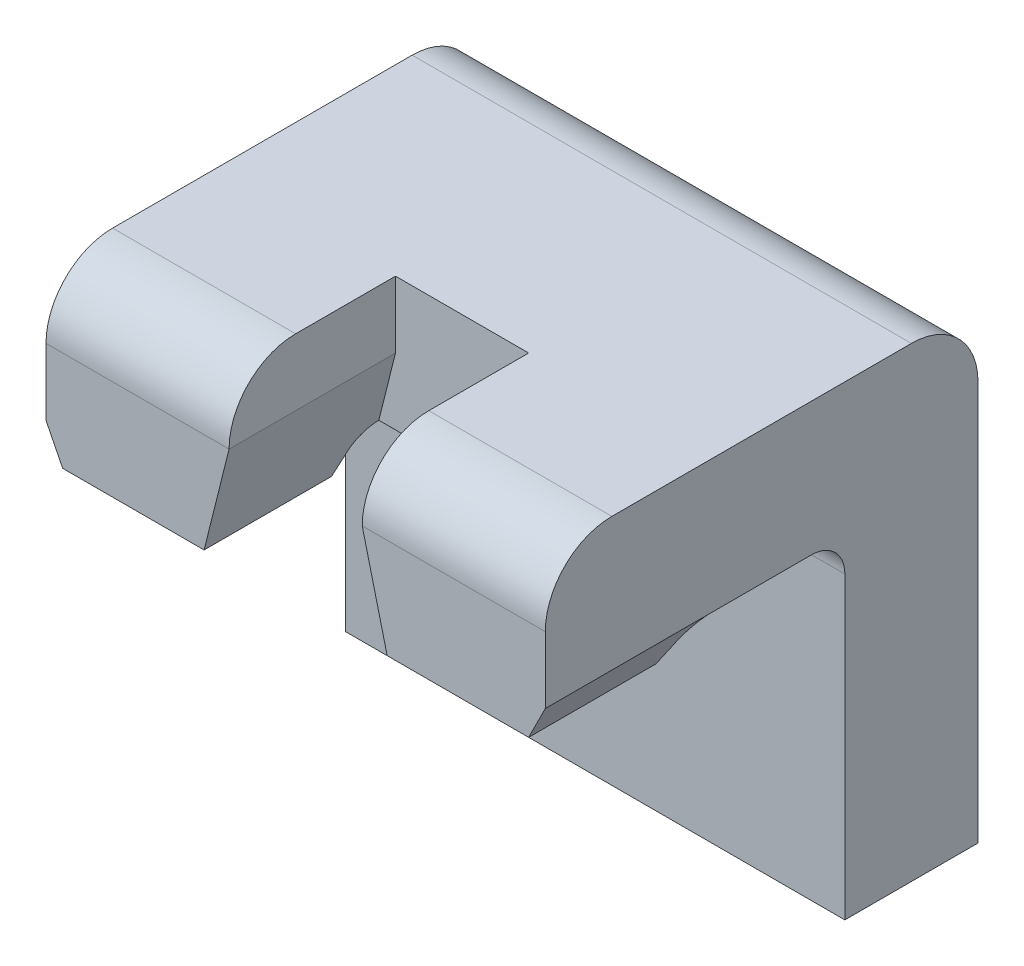
ISO-10303-21;
HEADER;
FILE_DESCRIPTION(('STEP AP214'),'2;1');
FILE_NAME('part.step','',(''),(''),'','','');
FILE_SCHEMA(('AUTOMOTIVE_DESIGN { 1 0 10303 214 1 1 1 1 }'));
ENDSEC;
DATA;
#1=APPLICATION_CONTEXT('core data for automotive mechanical design processes');
#2=APPLICATION_PROTOCOL_DEFINITION('international standard','automotive_design',2000,#1);
#3=PRODUCT_CONTEXT('',#1,'mechanical');
#4=PRODUCT('Part','Part','',(#3));
#5=PRODUCT_RELATED_PRODUCT_CATEGORY('part','',(#4));
#6=PRODUCT_DEFINITION_FORMATION('','',#4);
#7=PRODUCT_DEFINITION_CONTEXT('part definition',#1,'design');
#8=PRODUCT_DEFINITION('design','',#6,#7);
#9=PRODUCT_DEFINITION_SHAPE('','',#8);
#10=(LENGTH_UNIT() NAMED_UNIT(*) SI_UNIT(.MILLI.,.METRE.));
#11=(NAMED_UNIT(*) PLANE_ANGLE_UNIT() SI_UNIT($,.RADIAN.));
#12=(NAMED_UNIT(*) SI_UNIT($,.STERADIAN.) SOLID_ANGLE_UNIT());
#13=UNCERTAINTY_MEASURE_WITH_UNIT(LENGTH_MEASURE(1.E-05),#10,'distance_accuracy_value','');
#14=(GEOMETRIC_REPRESENTATION_CONTEXT(3) GLOBAL_UNCERTAINTY_ASSIGNED_CONTEXT((#13)) GLOBAL_UNIT_ASSIGNED_CONTEXT((#10,
#11,#12)) REPRESENTATION_CONTEXT('',''));
#15=CARTESIAN_POINT('',(0.,0.,0.));
#16=DIRECTION('',(0.,0.,1.));
#17=DIRECTION('',(1.,0.,0.));
#18=AXIS2_PLACEMENT_3D('',#15,#16,#17);
#19=CARTESIAN_POINT('',(-0.415796148106,0.4,0.49));
#20=DIRECTION('',(0.,0.531864359009179,0.846829559956285));
#21=DIRECTION('',(0.,-0.846829559956285,0.531864359009179));
#22=AXIS2_PLACEMENT_3D('',#19,#20,#21);
#23=PLANE('',#22);
#24=DIRECTION('',(-1.,0.,0.));
#25=VECTOR('',#24,1.);
#26=CARTESIAN_POINT('',(0.875,0.45,0.45859672925));
#27=LINE('',#26,#25);
#28=CARTESIAN_POINT('',(0.35,0.45,0.45859672925));
#29=VERTEX_POINT('',#28);
#30=CARTESIAN_POINT('',(0.137500000000008,0.450000000000002,0.45859672925));
#31=VERTEX_POINT('',#30);
#32=EDGE_CURVE('E301',#29,#31,#27,.T.);
#33=ORIENTED_EDGE('',*,*,#32,.T.);
#34=DIRECTION('',(-0.207116775159689,0.82846710063961,-0.520331533356617));
#35=VECTOR('',#34,1.);
#36=CARTESIAN_POINT('',(0.137500000000012,0.450000000000003,0.45859672925));
#37=LINE('',#36,#35);
#38=CARTESIAN_POINT('',(0.132202135712893,0.471191457148502,0.445287107921827));
#39=VERTEX_POINT('',#38);
#40=EDGE_CURVE('E274',#31,#39,#37,.T.);
#41=ORIENTED_EDGE('',*,*,#40,.T.);
#42=DIRECTION('',(1.,0.,0.));
#43=VECTOR('',#42,1.);
#44=CARTESIAN_POINT('',(-0.375,0.47119145714682,0.445287107922614));
#45=LINE('',#44,#43);
#46=CARTESIAN_POINT('',(0.360595728573993,0.471191457147986,0.445287107922069));
#47=VERTEX_POINT('',#46);
#48=EDGE_CURVE('E178',#39,#47,#45,.T.);
#49=ORIENTED_EDGE('',*,*,#48,.T.);
#50=DIRECTION('',(-0.389903858619995,-0.779807717239989,0.489770257535302));
#51=VECTOR('',#50,1.);
#52=CARTESIAN_POINT('',(0.3605957285734,0.4711914571468,0.445287107923));
#53=LINE('',#52,#51);
#54=EDGE_CURVE('E291',#47,#29,#53,.T.);
#55=ORIENTED_EDGE('',*,*,#54,.T.);
#56=EDGE_LOOP('',(#33,#41,#49,#55));
#57=FACE_BOUND('',#56,.T.);
#58=ADVANCED_FACE('F17',(#57),#23,.F.);
#59=CARTESIAN_POINT('',(0.875,0.45,0.));
#60=DIRECTION('',(0.,1.,0.));
#61=DIRECTION('',(-1.,0.,0.));
#62=AXIS2_PLACEMENT_3D('',#59,#60,#61);
#63=PLANE('',#62);
#64=DIRECTION('',(0.,0.,1.));
#65=VECTOR('',#64,1.);
#66=CARTESIAN_POINT('',(0.35,0.45,0.4));
#67=LINE('',#66,#65);
#68=CARTESIAN_POINT('',(0.35,0.45,0.65));
#69=VERTEX_POINT('',#68);
#70=EDGE_CURVE('E288',#29,#69,#67,.T.);
#71=ORIENTED_EDGE('',*,*,#70,.T.);
#72=DIRECTION('',(1.,0.,0.));
#73=VECTOR('',#72,1.);
#74=CARTESIAN_POINT('',(-0.375,0.45,0.65));
#75=LINE('',#74,#73);
#76=CARTESIAN_POINT('',(0.137500000000006,0.450000000000001,0.65));
#77=VERTEX_POINT('',#76);
#78=EDGE_CURVE('E290',#77,#69,#75,.T.);
#79=ORIENTED_EDGE('',*,*,#78,.F.);
#80=DIRECTION('',(0.,0.,1.));
#81=VECTOR('',#80,1.);
#82=CARTESIAN_POINT('',(0.137500000000012,0.450000000000003,0.4));
#83=LINE('',#82,#81);
#84=EDGE_CURVE('E279',#77,#31,#83,.F.);
#85=ORIENTED_EDGE('',*,*,#84,.T.);
#86=ORIENTED_EDGE('',*,*,#32,.F.);
#87=EDGE_LOOP('',(#71,#79,#85,#86));
#88=FACE_BOUND('',#87,.T.);
#89=ADVANCED_FACE('F391',(#88),#63,.F.);
#90=CARTESIAN_POINT('',(0.15,0.4,0.4));
#91=DIRECTION('',(0.970142500145391,0.242535625036098,0.));
#92=DIRECTION('',(-0.242535625036098,0.970142500145391,0.));
#93=AXIS2_PLACEMENT_3D('',#90,#91,#92);
#94=PLANE('',#93);
#95=ORIENTED_EDGE('',*,*,#84,.F.);
#96=DIRECTION('',(0.242535625036333,-0.970142500145332,0.));
#97=VECTOR('',#96,1.);
#98=CARTESIAN_POINT('',(0.1,0.6,0.65));
#99=LINE('',#98,#97);
#100=CARTESIAN_POINT('',(0.1,0.6,0.65));
#101=VERTEX_POINT('',#100);
#102=EDGE_CURVE('E282',#101,#77,#99,.T.);
#103=ORIENTED_EDGE('',*,*,#102,.F.);
#104=DIRECTION('',(0.,0.,1.));
#105=VECTOR('',#104,1.);
#106=CARTESIAN_POINT('',(0.1,0.6,0.4));
#107=LINE('',#106,#105);
#108=CARTESIAN_POINT('',(0.1,0.6,0.4));
#109=VERTEX_POINT('',#108);
#110=EDGE_CURVE('E164',#101,#109,#107,.F.);
#111=ORIENTED_EDGE('',*,*,#110,.T.);
#112=DIRECTION('',(0.242535625036333,-0.970142500145332,0.));
#113=VECTOR('',#112,1.);
#114=CARTESIAN_POINT('',(0.1,0.6,0.4));
#115=LINE('',#114,#113);
#116=CARTESIAN_POINT('',(0.125000000000013,0.5,0.4));
#117=VERTEX_POINT('',#116);
#118=EDGE_CURVE('E157',#109,#117,#115,.T.);
#119=ORIENTED_EDGE('',*,*,#118,.T.);
#120=CARTESIAN_POINT('',(0.137500000000013,0.45,0.4));
#121=DIRECTION('',(0.970142500145391,0.242535625036098,0.));
#122=DIRECTION('',(0.242535625036098,-0.970142500145391,0.));
#123=AXIS2_PLACEMENT_3D('',#120,#121,#122);
#124=ELLIPSE('',#123,0.0515388203202176,0.05);
#125=EDGE_CURVE('E20',#117,#39,#124,.T.);
#126=ORIENTED_EDGE('',*,*,#125,.T.);
#127=ORIENTED_EDGE('',*,*,#40,.F.);
#128=EDGE_LOOP('',(#95,#103,#111,#119,#126,#127));
#129=FACE_BOUND('',#128,.T.);
#130=ADVANCED_FACE('F160',(#129),#94,.F.);
#131=CARTESIAN_POINT('',(-0.415796148106,0.4,0.49));
#132=DIRECTION('',(0.,0.531864359009179,0.846829559956285));
#133=DIRECTION('',(0.,-0.846829559956285,0.531864359009179));
#134=AXIS2_PLACEMENT_3D('',#131,#132,#133);
#135=PLANE('',#134);
#136=DIRECTION('',(-1.,0.,0.));
#137=VECTOR('',#136,1.);
#138=CARTESIAN_POINT('',(0.875,0.45,0.45859672925));
#139=LINE('',#138,#137);
#140=CARTESIAN_POINT('',(-0.137500000000008,0.450000000000002,0.45859672925));
#141=VERTEX_POINT('',#140);
#142=CARTESIAN_POINT('',(-0.35,0.45,0.45859672925));
#143=VERTEX_POINT('',#142);
#144=EDGE_CURVE('E267',#141,#143,#139,.T.);
#145=ORIENTED_EDGE('',*,*,#144,.T.);
#146=DIRECTION('',(-0.389903858619995,0.779807717239989,-0.489770257535302));
#147=VECTOR('',#146,1.);
#148=CARTESIAN_POINT('',(-0.35,0.45,0.45859672925));
#149=LINE('',#148,#147);
#150=CARTESIAN_POINT('',(-0.360595728573993,0.471191457147986,0.445287107922069));
#151=VERTEX_POINT('',#150);
#152=EDGE_CURVE('E257',#143,#151,#149,.T.);
#153=ORIENTED_EDGE('',*,*,#152,.T.);
#154=DIRECTION('',(1.,0.,0.));
#155=VECTOR('',#154,1.);
#156=CARTESIAN_POINT('',(-0.375,0.47119145714682,0.445287107922614));
#157=LINE('',#156,#155);
#158=CARTESIAN_POINT('',(-0.132202135712893,0.471191457148502,0.445287107921827));
#159=VERTEX_POINT('',#158);
#160=EDGE_CURVE('E209',#151,#159,#157,.T.);
#161=ORIENTED_EDGE('',*,*,#160,.T.);
#162=DIRECTION('',(-0.207116775159689,-0.82846710063961,0.520331533356617));
#163=VECTOR('',#162,1.);
#164=CARTESIAN_POINT('',(-0.132202135713253,0.471191457147063,0.445287107923));
#165=LINE('',#164,#163);
#166=EDGE_CURVE('E265',#159,#141,#165,.T.);
#167=ORIENTED_EDGE('',*,*,#166,.T.);
#168=EDGE_LOOP('',(#145,#153,#161,#167));
#169=FACE_BOUND('',#168,.T.);
#170=ADVANCED_FACE('F425',(#169),#135,.F.);
#171=CARTESIAN_POINT('',(0.875,0.45,0.));
#172=DIRECTION('',(0.,1.,0.));
#173=DIRECTION('',(-1.,0.,0.));
#174=AXIS2_PLACEMENT_3D('',#171,#172,#173);
#175=PLANE('',#174);
#176=DIRECTION('',(0.,0.,1.));
#177=VECTOR('',#176,1.);
#178=CARTESIAN_POINT('',(-0.137500000000012,0.450000000000003,0.4));
#179=LINE('',#178,#177);
#180=CARTESIAN_POINT('',(-0.137500000000004,0.450000000000001,0.65));
#181=VERTEX_POINT('',#180);
#182=EDGE_CURVE('E241',#141,#181,#179,.T.);
#183=ORIENTED_EDGE('',*,*,#182,.T.);
#184=DIRECTION('',(1.,0.,0.));
#185=VECTOR('',#184,1.);
#186=CARTESIAN_POINT('',(-0.375,0.45,0.65));
#187=LINE('',#186,#185);
#188=CARTESIAN_POINT('',(-0.35,0.45,0.65));
#189=VERTEX_POINT('',#188);
#190=EDGE_CURVE('E251',#189,#181,#187,.T.);
#191=ORIENTED_EDGE('',*,*,#190,.F.);
#192=DIRECTION('',(0.,0.,1.));
#193=VECTOR('',#192,1.);
#194=CARTESIAN_POINT('',(-0.35,0.45,0.4));
#195=LINE('',#194,#193);
#196=EDGE_CURVE('E254',#189,#143,#195,.F.);
#197=ORIENTED_EDGE('',*,*,#196,.T.);
#198=ORIENTED_EDGE('',*,*,#144,.F.);
#199=EDGE_LOOP('',(#183,#191,#197,#198));
#200=FACE_BOUND('',#199,.T.);
#201=ADVANCED_FACE('F419',(#200),#175,.F.);
#202=CARTESIAN_POINT('',(-0.15,0.4,0.4));
#203=DIRECTION('',(-0.970142500145391,0.242535625036098,0.));
#204=DIRECTION('',(-0.242535625036098,-0.970142500145391,0.));
#205=AXIS2_PLACEMENT_3D('',#202,#203,#204);
#206=PLANE('',#205);
#207=ORIENTED_EDGE('',*,*,#182,.F.);
#208=ORIENTED_EDGE('',*,*,#166,.F.);
#209=CARTESIAN_POINT('',(-0.137500000000013,0.45,0.4));
#210=DIRECTION('',(-0.970142500145391,0.242535625036098,0.));
#211=DIRECTION('',(0.242535625036098,0.970142500145391,0.));
#212=AXIS2_PLACEMENT_3D('',#209,#210,#211);
#213=ELLIPSE('',#212,0.0515388203202176,0.05);
#214=CARTESIAN_POINT('',(-0.125000000000013,0.5,0.4));
#215=VERTEX_POINT('',#214);
#216=EDGE_CURVE('E210',#159,#215,#213,.T.);
#217=ORIENTED_EDGE('',*,*,#216,.T.);
#218=DIRECTION('',(0.242535625036333,0.970142500145332,0.));
#219=VECTOR('',#218,1.);
#220=CARTESIAN_POINT('',(-0.125,0.5,0.4));
#221=LINE('',#220,#219);
#222=CARTESIAN_POINT('',(-0.1,0.6,0.4));
#223=VERTEX_POINT('',#222);
#224=EDGE_CURVE('E169',#215,#223,#221,.T.);
#225=ORIENTED_EDGE('',*,*,#224,.T.);
#226=DIRECTION('',(0.,0.,1.));
#227=VECTOR('',#226,1.);
#228=CARTESIAN_POINT('',(-0.1,0.6,0.4));
#229=LINE('',#228,#227);
#230=CARTESIAN_POINT('',(-0.1,0.6,0.65));
#231=VERTEX_POINT('',#230);
#232=EDGE_CURVE('E218',#223,#231,#229,.T.);
#233=ORIENTED_EDGE('',*,*,#232,.T.);
#234=DIRECTION('',(0.242535625036333,0.970142500145332,0.));
#235=VECTOR('',#234,1.);
#236=CARTESIAN_POINT('',(-0.1375,0.45,0.65));
#237=LINE('',#236,#235);
#238=EDGE_CURVE('E247',#181,#231,#237,.T.);
#239=ORIENTED_EDGE('',*,*,#238,.F.);
#240=EDGE_LOOP('',(#207,#208,#217,#225,#233,#239));
#241=FACE_BOUND('',#240,.T.);
#242=ADVANCED_FACE('F340',(#241),#206,.F.);
#243=CARTESIAN_POINT('',(0.1,0.4,0.4));
#244=DIRECTION('',(1.,0.,0.));
#245=DIRECTION('',(0.,1.,0.));
#246=AXIS2_PLACEMENT_3D('',#243,#244,#245);
#247=PLANE('',#246);
#248=ORIENTED_EDGE('',*,*,#110,.F.);
#249=CARTESIAN_POINT('',(0.1,0.6,0.55));
#250=DIRECTION('',(1.,0.,0.));
#251=DIRECTION('',(0.,0.,-1.));
#252=AXIS2_PLACEMENT_3D('',#249,#250,#251);
#253=CIRCLE('',#252,0.1);
#254=CARTESIAN_POINT('',(0.1,0.7,0.55));
#255=VERTEX_POINT('',#254);
#256=EDGE_CURVE('E334',#255,#101,#253,.T.);
#257=ORIENTED_EDGE('',*,*,#256,.F.);
#258=DIRECTION('',(0.,0.,1.));
#259=VECTOR('',#258,1.);
#260=CARTESIAN_POINT('',(0.1,0.7,0.55));
#261=LINE('',#260,#259);
#262=CARTESIAN_POINT('',(0.1,0.7,0.4));
#263=VERTEX_POINT('',#262);
#264=EDGE_CURVE('E208',#263,#255,#261,.T.);
#265=ORIENTED_EDGE('',*,*,#264,.F.);
#266=DIRECTION('',(0.,1.,0.));
#267=VECTOR('',#266,1.);
#268=CARTESIAN_POINT('',(0.1,0.7,0.4));
#269=LINE('',#268,#267);
#270=EDGE_CURVE('E170',#263,#109,#269,.F.);
#271=ORIENTED_EDGE('',*,*,#270,.T.);
#272=EDGE_LOOP('',(#248,#257,#265,#271));
#273=FACE_BOUND('',#272,.T.);
#274=ADVANCED_FACE('F404',(#273),#247,.F.);
#275=CARTESIAN_POINT('',(-0.1,0.4,0.4));
#276=DIRECTION('',(-1.,0.,0.));
#277=DIRECTION('',(0.,-1.,0.));
#278=AXIS2_PLACEMENT_3D('',#275,#276,#277);
#279=PLANE('',#278);
#280=ORIENTED_EDGE('',*,*,#232,.F.);
#281=DIRECTION('',(0.,1.,0.));
#282=VECTOR('',#281,1.);
#283=CARTESIAN_POINT('',(-0.1,0.7,0.4));
#284=LINE('',#283,#282);
#285=CARTESIAN_POINT('',(-0.1,0.7,0.4));
#286=VERTEX_POINT('',#285);
#287=EDGE_CURVE('E179',#223,#286,#284,.T.);
#288=ORIENTED_EDGE('',*,*,#287,.T.);
#289=DIRECTION('',(0.,0.,1.));
#290=VECTOR('',#289,1.);
#291=CARTESIAN_POINT('',(-0.1,0.7,0.55));
#292=LINE('',#291,#290);
#293=CARTESIAN_POINT('',(-0.1,0.7,0.55));
#294=VERTEX_POINT('',#293);
#295=EDGE_CURVE('E222',#294,#286,#292,.F.);
#296=ORIENTED_EDGE('',*,*,#295,.F.);
#297=CARTESIAN_POINT('',(-0.1,0.6,0.55));
#298=DIRECTION('',(1.,0.,0.));
#299=DIRECTION('',(0.,0.,-1.));
#300=AXIS2_PLACEMENT_3D('',#297,#298,#299);
#301=CIRCLE('',#300,0.1);
#302=EDGE_CURVE('E329',#231,#294,#301,.F.);
#303=ORIENTED_EDGE('',*,*,#302,.F.);
#304=EDGE_LOOP('',(#280,#288,#296,#303));
#305=FACE_BOUND('',#304,.T.);
#306=ADVANCED_FACE('F412',(#305),#279,.F.);
#307=CARTESIAN_POINT('',(-0.375,0.45,0.4));
#308=DIRECTION('',(1.,0.,0.));
#309=DIRECTION('',(0.,0.,-1.));
#310=AXIS2_PLACEMENT_3D('',#307,#308,#309);
#311=CYLINDRICAL_SURFACE('',#310,0.05);
#312=DIRECTION('',(1.,0.,0.));
#313=VECTOR('',#312,1.);
#314=CARTESIAN_POINT('',(-0.375,0.5,0.4));
#315=LINE('',#314,#313);
#316=CARTESIAN_POINT('',(0.375,0.5,0.4));
#317=VERTEX_POINT('',#316);
#318=EDGE_CURVE('E176',#317,#117,#315,.F.);
#319=ORIENTED_EDGE('',*,*,#318,.F.);
#320=CARTESIAN_POINT('',(0.35,0.45,0.4));
#321=DIRECTION('',(-0.894427190999916,0.447213595499958,0.));
#322=DIRECTION('',(0.447213595499958,0.894427190999916,0.));
#323=AXIS2_PLACEMENT_3D('',#320,#321,#322);
#324=ELLIPSE('',#323,0.0559016994374947,0.05);
#325=EDGE_CURVE('E332',#317,#47,#324,.F.);
#326=ORIENTED_EDGE('',*,*,#325,.T.);
#327=ORIENTED_EDGE('',*,*,#48,.F.);
#328=ORIENTED_EDGE('',*,*,#125,.F.);
#329=EDGE_LOOP('',(#319,#326,#327,#328));
#330=FACE_BOUND('',#329,.T.);
#331=ADVANCED_FACE('F173',(#330),#311,.F.);
#332=CARTESIAN_POINT('',(0.1,0.7,0.4));
#333=DIRECTION('',(0.,0.,-1.));
#334=DIRECTION('',(-1.,0.,0.));
#335=AXIS2_PLACEMENT_3D('',#332,#333,#334);
#336=PLANE('',#335);
#337=DIRECTION('',(1.,0.,0.));
#338=VECTOR('',#337,1.);
#339=CARTESIAN_POINT('',(-0.375,0.5,0.4));
#340=LINE('',#339,#338);
#341=EDGE_CURVE('E182',#117,#215,#340,.F.);
#342=ORIENTED_EDGE('',*,*,#341,.F.);
#343=ORIENTED_EDGE('',*,*,#118,.F.);
#344=ORIENTED_EDGE('',*,*,#270,.F.);
#345=DIRECTION('',(1.,0.,0.));
#346=VECTOR('',#345,1.);
#347=CARTESIAN_POINT('',(-0.375,0.7,0.4));
#348=LINE('',#347,#346);
#349=EDGE_CURVE('E225',#286,#263,#348,.T.);
#350=ORIENTED_EDGE('',*,*,#349,.F.);
#351=ORIENTED_EDGE('',*,*,#287,.F.);
#352=ORIENTED_EDGE('',*,*,#224,.F.);
#353=EDGE_LOOP('',(#342,#343,#344,#350,#351,#352));
#354=FACE_BOUND('',#353,.T.);
#355=ADVANCED_FACE('F183',(#354),#336,.F.);
#356=CARTESIAN_POINT('',(-0.375,0.45,0.4));
#357=DIRECTION('',(1.,0.,0.));
#358=DIRECTION('',(0.,0.,-1.));
#359=AXIS2_PLACEMENT_3D('',#356,#357,#358);
#360=CYLINDRICAL_SURFACE('',#359,0.05);
#361=DIRECTION('',(1.,0.,0.));
#362=VECTOR('',#361,1.);
#363=CARTESIAN_POINT('',(-0.375,0.5,0.4));
#364=LINE('',#363,#362);
#365=CARTESIAN_POINT('',(-0.375,0.5,0.4));
#366=VERTEX_POINT('',#365);
#367=EDGE_CURVE('E189',#215,#366,#364,.F.);
#368=ORIENTED_EDGE('',*,*,#367,.F.);
#369=ORIENTED_EDGE('',*,*,#216,.F.);
#370=ORIENTED_EDGE('',*,*,#160,.F.);
#371=CARTESIAN_POINT('',(-0.35,0.45,0.4));
#372=DIRECTION('',(0.894427190999916,0.447213595499958,0.));
#373=DIRECTION('',(0.447213595499958,-0.894427190999916,0.));
#374=AXIS2_PLACEMENT_3D('',#371,#372,#373);
#375=ELLIPSE('',#374,0.0559016994374947,0.05);
#376=EDGE_CURVE('E258',#151,#366,#375,.F.);
#377=ORIENTED_EDGE('',*,*,#376,.T.);
#378=EDGE_LOOP('',(#368,#369,#370,#377));
#379=FACE_BOUND('',#378,.T.);
#380=ADVANCED_FACE('F342',(#379),#360,.F.);
#381=CARTESIAN_POINT('',(-0.375,0.6,0.55));
#382=DIRECTION('',(1.,0.,0.));
#383=DIRECTION('',(0.,0.,-1.));
#384=AXIS2_PLACEMENT_3D('',#381,#382,#383);
#385=CYLINDRICAL_SURFACE('',#384,0.1);
#386=CARTESIAN_POINT('',(0.375,0.6,0.55));
#387=DIRECTION('',(1.,0.,0.));
#388=DIRECTION('',(0.,0.,-1.));
#389=AXIS2_PLACEMENT_3D('',#386,#387,#388);
#390=CIRCLE('',#389,0.1);
#391=CARTESIAN_POINT('',(0.375,0.6,0.65));
#392=VERTEX_POINT('',#391);
#393=CARTESIAN_POINT('',(0.375,0.7,0.55));
#394=VERTEX_POINT('',#393);
#395=EDGE_CURVE('E326',#392,#394,#390,.F.);
#396=ORIENTED_EDGE('',*,*,#395,.T.);
#397=DIRECTION('',(1.,0.,0.));
#398=VECTOR('',#397,1.);
#399=CARTESIAN_POINT('',(-0.375,0.7,0.55));
#400=LINE('',#399,#398);
#401=EDGE_CURVE('E204',#255,#394,#400,.T.);
#402=ORIENTED_EDGE('',*,*,#401,.F.);
#403=ORIENTED_EDGE('',*,*,#256,.T.);
#404=DIRECTION('',(1.,0.,0.));
#405=VECTOR('',#404,1.);
#406=CARTESIAN_POINT('',(-0.375,0.6,0.65));
#407=LINE('',#406,#405);
#408=EDGE_CURVE('E285',#392,#101,#407,.F.);
#409=ORIENTED_EDGE('',*,*,#408,.F.);
#410=EDGE_LOOP('',(#396,#402,#403,#409));
#411=FACE_BOUND('',#410,.T.);
#412=ADVANCED_FACE('F401',(#411),#385,.T.);
#413=CARTESIAN_POINT('',(0.375,0.5,0.4));
#414=DIRECTION('',(-0.894427190999916,0.447213595499958,0.));
#415=DIRECTION('',(-0.447213595499958,-0.894427190999916,0.));
#416=AXIS2_PLACEMENT_3D('',#413,#414,#415);
#417=PLANE('',#416);
#418=ORIENTED_EDGE('',*,*,#70,.F.);
#419=ORIENTED_EDGE('',*,*,#54,.F.);
#420=ORIENTED_EDGE('',*,*,#325,.F.);
#421=DIRECTION('',(0.,0.,1.));
#422=VECTOR('',#421,1.);
#423=CARTESIAN_POINT('',(0.375,0.5,0.25));
#424=LINE('',#423,#422);
#425=CARTESIAN_POINT('',(0.375,0.5,0.65));
#426=VERTEX_POINT('',#425);
#427=EDGE_CURVE('E381',#317,#426,#424,.T.);
#428=ORIENTED_EDGE('',*,*,#427,.T.);
#429=DIRECTION('',(0.447213595499959,0.894427190999915,0.));
#430=VECTOR('',#429,1.);
#431=CARTESIAN_POINT('',(0.35,0.45,0.65));
#432=LINE('',#431,#430);
#433=EDGE_CURVE('E296',#69,#426,#432,.T.);
#434=ORIENTED_EDGE('',*,*,#433,.F.);
#435=EDGE_LOOP('',(#418,#419,#420,#428,#434));
#436=FACE_BOUND('',#435,.T.);
#437=ADVANCED_FACE('F393',(#436),#417,.F.);
#438=CARTESIAN_POINT('',(-0.375,0.4,0.65));
#439=DIRECTION('',(0.,0.,1.));
#440=DIRECTION('',(1.,0.,0.));
#441=AXIS2_PLACEMENT_3D('',#438,#439,#440);
#442=PLANE('',#441);
#443=ORIENTED_EDGE('',*,*,#408,.T.);
#444=ORIENTED_EDGE('',*,*,#102,.T.);
#445=ORIENTED_EDGE('',*,*,#78,.T.);
#446=ORIENTED_EDGE('',*,*,#433,.T.);
#447=DIRECTION('',(0.,1.,0.));
#448=VECTOR('',#447,1.);
#449=CARTESIAN_POINT('',(0.375,0.45,0.65));
#450=LINE('',#449,#448);
#451=EDGE_CURVE('E383',#426,#392,#450,.T.);
#452=ORIENTED_EDGE('',*,*,#451,.T.);
#453=EDGE_LOOP('',(#443,#444,#445,#446,#452));
#454=FACE_BOUND('',#453,.T.);
#455=ADVANCED_FACE('F398',(#454),#442,.T.);
#456=CARTESIAN_POINT('',(-0.375,0.5,0.4));
#457=DIRECTION('',(0.894427190999916,0.447213595499958,0.));
#458=DIRECTION('',(-0.447213595499958,0.894427190999916,0.));
#459=AXIS2_PLACEMENT_3D('',#456,#457,#458);
#460=PLANE('',#459);
#461=ORIENTED_EDGE('',*,*,#196,.F.);
#462=DIRECTION('',(0.447213595499958,-0.894427190999916,0.));
#463=VECTOR('',#462,1.);
#464=CARTESIAN_POINT('',(-0.375,0.5,0.65));
#465=LINE('',#464,#463);
#466=CARTESIAN_POINT('',(-0.375,0.5,0.65));
#467=VERTEX_POINT('',#466);
#468=EDGE_CURVE('E250',#467,#189,#465,.T.);
#469=ORIENTED_EDGE('',*,*,#468,.F.);
#470=DIRECTION('',(0.,0.,1.));
#471=VECTOR('',#470,1.);
#472=CARTESIAN_POINT('',(-0.375,0.5,0.25));
#473=LINE('',#472,#471);
#474=EDGE_CURVE('E353',#366,#467,#473,.T.);
#475=ORIENTED_EDGE('',*,*,#474,.F.);
#476=ORIENTED_EDGE('',*,*,#376,.F.);
#477=ORIENTED_EDGE('',*,*,#152,.F.);
#478=EDGE_LOOP('',(#461,#469,#475,#476,#477));
#479=FACE_BOUND('',#478,.T.);
#480=ADVANCED_FACE('F423',(#479),#460,.F.);
#481=CARTESIAN_POINT('',(-0.375,0.4,0.65));
#482=DIRECTION('',(0.,0.,1.));
#483=DIRECTION('',(1.,0.,0.));
#484=AXIS2_PLACEMENT_3D('',#481,#482,#483);
#485=PLANE('',#484);
#486=DIRECTION('',(0.,1.,0.));
#487=VECTOR('',#486,1.);
#488=CARTESIAN_POINT('',(-0.375,0.45,0.65));
#489=LINE('',#488,#487);
#490=CARTESIAN_POINT('',(-0.375,0.6,0.65));
#491=VERTEX_POINT('',#490);
#492=EDGE_CURVE('E319',#467,#491,#489,.T.);
#493=ORIENTED_EDGE('',*,*,#492,.F.);
#494=ORIENTED_EDGE('',*,*,#468,.T.);
#495=ORIENTED_EDGE('',*,*,#190,.T.);
#496=ORIENTED_EDGE('',*,*,#238,.T.);
#497=DIRECTION('',(1.,0.,0.));
#498=VECTOR('',#497,1.);
#499=CARTESIAN_POINT('',(-0.375,0.6,0.65));
#500=LINE('',#499,#498);
#501=EDGE_CURVE('E237',#491,#231,#500,.T.);
#502=ORIENTED_EDGE('',*,*,#501,.F.);
#503=EDGE_LOOP('',(#493,#494,#495,#496,#502));
#504=FACE_BOUND('',#503,.T.);
#505=ADVANCED_FACE('F416',(#504),#485,.T.);
#506=CARTESIAN_POINT('',(-0.375,0.6,0.55));
#507=DIRECTION('',(1.,0.,0.));
#508=DIRECTION('',(0.,0.,-1.));
#509=AXIS2_PLACEMENT_3D('',#506,#507,#508);
#510=CYLINDRICAL_SURFACE('',#509,0.1);
#511=CARTESIAN_POINT('',(-0.375,0.6,0.55));
#512=DIRECTION('',(1.,0.,0.));
#513=DIRECTION('',(0.,0.,-1.));
#514=AXIS2_PLACEMENT_3D('',#511,#512,#513);
#515=CIRCLE('',#514,0.1);
#516=CARTESIAN_POINT('',(-0.375,0.7,0.55));
#517=VERTEX_POINT('',#516);
#518=EDGE_CURVE('E316',#491,#517,#515,.F.);
#519=ORIENTED_EDGE('',*,*,#518,.F.);
#520=ORIENTED_EDGE('',*,*,#501,.T.);
#521=ORIENTED_EDGE('',*,*,#302,.T.);
#522=DIRECTION('',(1.,0.,0.));
#523=VECTOR('',#522,1.);
#524=CARTESIAN_POINT('',(-0.375,0.7,0.55));
#525=LINE('',#524,#523);
#526=EDGE_CURVE('E207',#517,#294,#525,.T.);
#527=ORIENTED_EDGE('',*,*,#526,.F.);
#528=EDGE_LOOP('',(#519,#520,#521,#527));
#529=FACE_BOUND('',#528,.T.);
#530=ADVANCED_FACE('F470',(#529),#510,.T.);
#531=CARTESIAN_POINT('',(-0.375,0.7,0.55));
#532=DIRECTION('',(0.,1.,0.));
#533=DIRECTION('',(0.,0.,1.));
#534=AXIS2_PLACEMENT_3D('',#531,#532,#533);
#535=PLANE('',#534);
#536=ORIENTED_EDGE('',*,*,#295,.T.);
#537=ORIENTED_EDGE('',*,*,#349,.T.);
#538=ORIENTED_EDGE('',*,*,#264,.T.);
#539=ORIENTED_EDGE('',*,*,#401,.T.);
#540=DIRECTION('',(0.,0.,1.));
#541=VECTOR('',#540,1.);
#542=CARTESIAN_POINT('',(0.375,0.7,0.25));
#543=LINE('',#542,#541);
#544=CARTESIAN_POINT('',(0.375,0.7,0.1));
#545=VERTEX_POINT('',#544);
#546=EDGE_CURVE('E325',#394,#545,#543,.F.);
#547=ORIENTED_EDGE('',*,*,#546,.T.);
#548=DIRECTION('',(1.,0.,0.));
#549=VECTOR('',#548,1.);
#550=CARTESIAN_POINT('',(-0.375,0.7,0.1));
#551=LINE('',#550,#549);
#552=CARTESIAN_POINT('',(-0.375,0.7,0.1));
#553=VERTEX_POINT('',#552);
#554=EDGE_CURVE('E328',#553,#545,#551,.T.);
#555=ORIENTED_EDGE('',*,*,#554,.F.);
#556=DIRECTION('',(0.,0.,1.));
#557=VECTOR('',#556,1.);
#558=CARTESIAN_POINT('',(-0.375,0.7,0.25));
#559=LINE('',#558,#557);
#560=EDGE_CURVE('E315',#517,#553,#559,.F.);
#561=ORIENTED_EDGE('',*,*,#560,.F.);
#562=ORIENTED_EDGE('',*,*,#526,.T.);
#563=EDGE_LOOP('',(#536,#537,#538,#539,#547,#555,#561,#562));
#564=FACE_BOUND('',#563,.T.);
#565=ADVANCED_FACE('F407',(#564),#535,.T.);
#566=CARTESIAN_POINT('',(-0.375,0.,0.2));
#567=DIRECTION('',(0.,0.,1.));
#568=DIRECTION('',(1.,0.,0.));
#569=AXIS2_PLACEMENT_3D('',#566,#567,#568);
#570=PLANE('',#569);
#571=DIRECTION('',(1.,0.,0.));
#572=VECTOR('',#571,1.);
#573=CARTESIAN_POINT('',(-0.375,0.45,0.2));
#574=LINE('',#573,#572);
#575=CARTESIAN_POINT('',(0.375,0.45,0.2));
#576=VERTEX_POINT('',#575);
#577=CARTESIAN_POINT('',(-0.375,0.45,0.2));
#578=VERTEX_POINT('',#577);
#579=EDGE_CURVE('E198',#576,#578,#574,.F.);
#580=ORIENTED_EDGE('',*,*,#579,.T.);
#581=DIRECTION('',(0.,1.,0.));
#582=VECTOR('',#581,1.);
#583=CARTESIAN_POINT('',(-0.375,0.45,0.2));
#584=LINE('',#583,#582);
#585=CARTESIAN_POINT('',(-0.375,0.,0.2));
#586=VERTEX_POINT('',#585);
#587=EDGE_CURVE('E311',#586,#578,#584,.T.);
#588=ORIENTED_EDGE('',*,*,#587,.F.);
#589=DIRECTION('',(1.,0.,0.));
#590=VECTOR('',#589,1.);
#591=CARTESIAN_POINT('',(-0.375,0.,0.2));
#592=LINE('',#591,#590);
#593=CARTESIAN_POINT('',(0.375,0.,0.2));
#594=VERTEX_POINT('',#593);
#595=EDGE_CURVE('E356',#594,#586,#592,.F.);
#596=ORIENTED_EDGE('',*,*,#595,.F.);
#597=DIRECTION('',(0.,1.,0.));
#598=VECTOR('',#597,1.);
#599=CARTESIAN_POINT('',(0.375,0.45,0.2));
#600=LINE('',#599,#598);
#601=EDGE_CURVE('E322',#594,#576,#600,.T.);
#602=ORIENTED_EDGE('',*,*,#601,.T.);
#603=EDGE_LOOP('',(#580,#588,#596,#602));
#604=FACE_BOUND('',#603,.T.);
#605=ADVANCED_FACE('F463',(#604),#570,.T.);
#606=CARTESIAN_POINT('',(-0.375,0.45,0.25));
#607=DIRECTION('',(1.,0.,0.));
#608=DIRECTION('',(0.,0.,-1.));
#609=AXIS2_PLACEMENT_3D('',#606,#607,#608);
#610=CYLINDRICAL_SURFACE('',#609,0.05);
#611=DIRECTION('',(1.,0.,0.));
#612=VECTOR('',#611,1.);
#613=CARTESIAN_POINT('',(-0.375,0.5,0.25));
#614=LINE('',#613,#612);
#615=CARTESIAN_POINT('',(-0.375,0.5,0.25));
#616=VERTEX_POINT('',#615);
#617=CARTESIAN_POINT('',(0.375,0.5,0.25));
#618=VERTEX_POINT('',#617);
#619=EDGE_CURVE('E196',#616,#618,#614,.T.);
#620=ORIENTED_EDGE('',*,*,#619,.F.);
#621=CARTESIAN_POINT('',(-0.375,0.45,0.25));
#622=DIRECTION('',(1.,0.,0.));
#623=DIRECTION('',(0.,0.,-1.));
#624=AXIS2_PLACEMENT_3D('',#621,#622,#623);
#625=CIRCLE('',#624,0.05);
#626=EDGE_CURVE('E307',#578,#616,#625,.T.);
#627=ORIENTED_EDGE('',*,*,#626,.F.);
#628=ORIENTED_EDGE('',*,*,#579,.F.);
#629=CARTESIAN_POINT('',(0.375,0.45,0.25));
#630=DIRECTION('',(1.,0.,0.));
#631=DIRECTION('',(0.,0.,-1.));
#632=AXIS2_PLACEMENT_3D('',#629,#630,#631);
#633=CIRCLE('',#632,0.05);
#634=EDGE_CURVE('E320',#576,#618,#633,.T.);
#635=ORIENTED_EDGE('',*,*,#634,.T.);
#636=EDGE_LOOP('',(#620,#627,#628,#635));
#637=FACE_BOUND('',#636,.T.);
#638=ADVANCED_FACE('F460',(#637),#610,.F.);
#639=CARTESIAN_POINT('',(-0.375,0.5,0.25));
#640=DIRECTION('',(0.,-1.,0.));
#641=DIRECTION('',(0.,0.,-1.));
#642=AXIS2_PLACEMENT_3D('',#639,#640,#641);
#643=PLANE('',#642);
#644=ORIENTED_EDGE('',*,*,#367,.T.);
#645=DIRECTION('',(0.,0.,1.));
#646=VECTOR('',#645,1.);
#647=CARTESIAN_POINT('',(-0.375,0.5,0.25));
#648=LINE('',#647,#646);
#649=EDGE_CURVE('E310',#616,#366,#648,.T.);
#650=ORIENTED_EDGE('',*,*,#649,.F.);
#651=ORIENTED_EDGE('',*,*,#619,.T.);
#652=DIRECTION('',(0.,0.,1.));
#653=VECTOR('',#652,1.);
#654=CARTESIAN_POINT('',(0.375,0.5,0.25));
#655=LINE('',#654,#653);
#656=EDGE_CURVE('E194',#618,#317,#655,.T.);
#657=ORIENTED_EDGE('',*,*,#656,.T.);
#658=ORIENTED_EDGE('',*,*,#318,.T.);
#659=ORIENTED_EDGE('',*,*,#341,.T.);
#660=EDGE_LOOP('',(#644,#650,#651,#657,#658,#659));
#661=FACE_BOUND('',#660,.T.);
#662=ADVANCED_FACE('F191',(#661),#643,.T.);
#663=CARTESIAN_POINT('',(-0.375,0.6,0.1));
#664=DIRECTION('',(1.,0.,0.));
#665=DIRECTION('',(0.,0.,-1.));
#666=AXIS2_PLACEMENT_3D('',#663,#664,#665);
#667=CYLINDRICAL_SURFACE('',#666,0.1);
#668=DIRECTION('',(-1.,0.,0.));
#669=VECTOR('',#668,1.);
#670=CARTESIAN_POINT('',(-0.375,0.6,0.));
#671=LINE('',#670,#669);
#672=CARTESIAN_POINT('',(-0.375,0.6,0.));
#673=VERTEX_POINT('',#672);
#674=CARTESIAN_POINT('',(0.375,0.6,0.));
#675=VERTEX_POINT('',#674);
#676=EDGE_CURVE('E665',#673,#675,#671,.F.);
#677=ORIENTED_EDGE('',*,*,#676,.F.);
#678=CARTESIAN_POINT('',(-0.375,0.6,0.1));
#679=DIRECTION('',(1.,0.,0.));
#680=DIRECTION('',(0.,0.,-1.));
#681=AXIS2_PLACEMENT_3D('',#678,#679,#680);
#682=CIRCLE('',#681,0.1);
#683=EDGE_CURVE('E312',#553,#673,#682,.F.);
#684=ORIENTED_EDGE('',*,*,#683,.F.);
#685=ORIENTED_EDGE('',*,*,#554,.T.);
#686=CARTESIAN_POINT('',(0.375,0.6,0.1));
#687=DIRECTION('',(1.,0.,0.));
#688=DIRECTION('',(0.,0.,-1.));
#689=AXIS2_PLACEMENT_3D('',#686,#687,#688);
#690=CIRCLE('',#689,0.1);
#691=EDGE_CURVE('E323',#545,#675,#690,.F.);
#692=ORIENTED_EDGE('',*,*,#691,.T.);
#693=EDGE_LOOP('',(#677,#684,#685,#692));
#694=FACE_BOUND('',#693,.T.);
#695=ADVANCED_FACE('F453',(#694),#667,.T.);
#696=CARTESIAN_POINT('',(0.375,0.45,0.25));
#697=DIRECTION('',(-1.,0.,0.));
#698=DIRECTION('',(0.,0.,1.));
#699=AXIS2_PLACEMENT_3D('',#696,#697,#698);
#700=PLANE('',#699);
#701=ORIENTED_EDGE('',*,*,#427,.F.);
#702=ORIENTED_EDGE('',*,*,#656,.F.);
#703=ORIENTED_EDGE('',*,*,#634,.F.);
#704=ORIENTED_EDGE('',*,*,#601,.F.);
#705=DIRECTION('',(0.,0.,-1.));
#706=VECTOR('',#705,1.);
#707=CARTESIAN_POINT('',(0.375,0.,0.));
#708=LINE('',#707,#706);
#709=CARTESIAN_POINT('',(0.375,0.,0.));
#710=VERTEX_POINT('',#709);
#711=EDGE_CURVE('E361',#710,#594,#708,.F.);
#712=ORIENTED_EDGE('',*,*,#711,.F.);
#713=DIRECTION('',(0.,1.,0.));
#714=VECTOR('',#713,1.);
#715=CARTESIAN_POINT('',(0.375,0.6,0.));
#716=LINE('',#715,#714);
#717=EDGE_CURVE('E667',#675,#710,#716,.F.);
#718=ORIENTED_EDGE('',*,*,#717,.F.);
#719=ORIENTED_EDGE('',*,*,#691,.F.);
#720=ORIENTED_EDGE('',*,*,#546,.F.);
#721=ORIENTED_EDGE('',*,*,#395,.F.);
#722=ORIENTED_EDGE('',*,*,#451,.F.);
#723=EDGE_LOOP('',(#701,#702,#703,#704,#712,#718,#719,#720,#721,#722));
#724=FACE_BOUND('',#723,.T.);
#725=ADVANCED_FACE('F450',(#724),#700,.F.);
#726=CARTESIAN_POINT('',(-0.375,0.,0.));
#727=DIRECTION('',(0.,-1.,0.));
#728=DIRECTION('',(0.,0.,-1.));
#729=AXIS2_PLACEMENT_3D('',#726,#727,#728);
#730=PLANE('',#729);
#731=ORIENTED_EDGE('',*,*,#595,.T.);
#732=DIRECTION('',(0.,0.,1.));
#733=VECTOR('',#732,1.);
#734=CARTESIAN_POINT('',(-0.375,0.,0.25));
#735=LINE('',#734,#733);
#736=CARTESIAN_POINT('',(-0.375,0.,0.));
#737=VERTEX_POINT('',#736);
#738=EDGE_CURVE('E35',#737,#586,#735,.T.);
#739=ORIENTED_EDGE('',*,*,#738,.F.);
#740=DIRECTION('',(-1.,0.,0.));
#741=VECTOR('',#740,1.);
#742=CARTESIAN_POINT('',(-0.375,0.,0.));
#743=LINE('',#742,#741);
#744=EDGE_CURVE('E26',#710,#737,#743,.T.);
#745=ORIENTED_EDGE('',*,*,#744,.F.);
#746=ORIENTED_EDGE('',*,*,#711,.T.);
#747=EDGE_LOOP('',(#731,#739,#745,#746));
#748=FACE_BOUND('',#747,.T.);
#749=ADVANCED_FACE('F443',(#748),#730,.T.);
#750=CARTESIAN_POINT('',(-0.375,0.45,0.25));
#751=DIRECTION('',(-1.,0.,0.));
#752=DIRECTION('',(0.,0.,1.));
#753=AXIS2_PLACEMENT_3D('',#750,#751,#752);
#754=PLANE('',#753);
#755=ORIENTED_EDGE('',*,*,#626,.T.);
#756=ORIENTED_EDGE('',*,*,#649,.T.);
#757=ORIENTED_EDGE('',*,*,#474,.T.);
#758=ORIENTED_EDGE('',*,*,#492,.T.);
#759=ORIENTED_EDGE('',*,*,#518,.T.);
#760=ORIENTED_EDGE('',*,*,#560,.T.);
#761=ORIENTED_EDGE('',*,*,#683,.T.);
#762=DIRECTION('',(0.,1.,0.));
#763=VECTOR('',#762,1.);
#764=CARTESIAN_POINT('',(-0.375,0.6,0.));
#765=LINE('',#764,#763);
#766=EDGE_CURVE('E11',#737,#673,#765,.T.);
#767=ORIENTED_EDGE('',*,*,#766,.F.);
#768=ORIENTED_EDGE('',*,*,#738,.T.);
#769=ORIENTED_EDGE('',*,*,#587,.T.);
#770=EDGE_LOOP('',(#755,#756,#757,#758,#759,#760,#761,#767,#768,#769));
#771=FACE_BOUND('',#770,.T.);
#772=ADVANCED_FACE('F437',(#771),#754,.T.);
#773=CARTESIAN_POINT('',(-0.375,0.6,0.));
#774=DIRECTION('',(0.,0.,-1.));
#775=DIRECTION('',(-1.,0.,0.));
#776=AXIS2_PLACEMENT_3D('',#773,#774,#775);
#777=PLANE('',#776);
#778=ORIENTED_EDGE('',*,*,#744,.T.);
#779=ORIENTED_EDGE('',*,*,#766,.T.);
#780=ORIENTED_EDGE('',*,*,#676,.T.);
#781=ORIENTED_EDGE('',*,*,#717,.T.);
#782=EDGE_LOOP('',(#778,#779,#780,#781));
#783=FACE_BOUND('',#782,.T.);
#784=ADVANCED_FACE('F435',(#783),#777,.T.);
#785=CLOSED_SHELL('',(#58,#89,#130,#170,#201,#242,#274,#306,#331,#355,#380,#412,#437,#455,#480,
#505,#530,#565,#605,#638,#662,#695,#725,#749,#772,#784));
#786=MANIFOLD_SOLID_BREP('B1',#785);
#787=ADVANCED_BREP_SHAPE_REPRESENTATION('',(#18,#786),#14);
#788=SHAPE_DEFINITION_REPRESENTATION(#9,#787);
ENDSEC;
END-ISO-10303-21;
